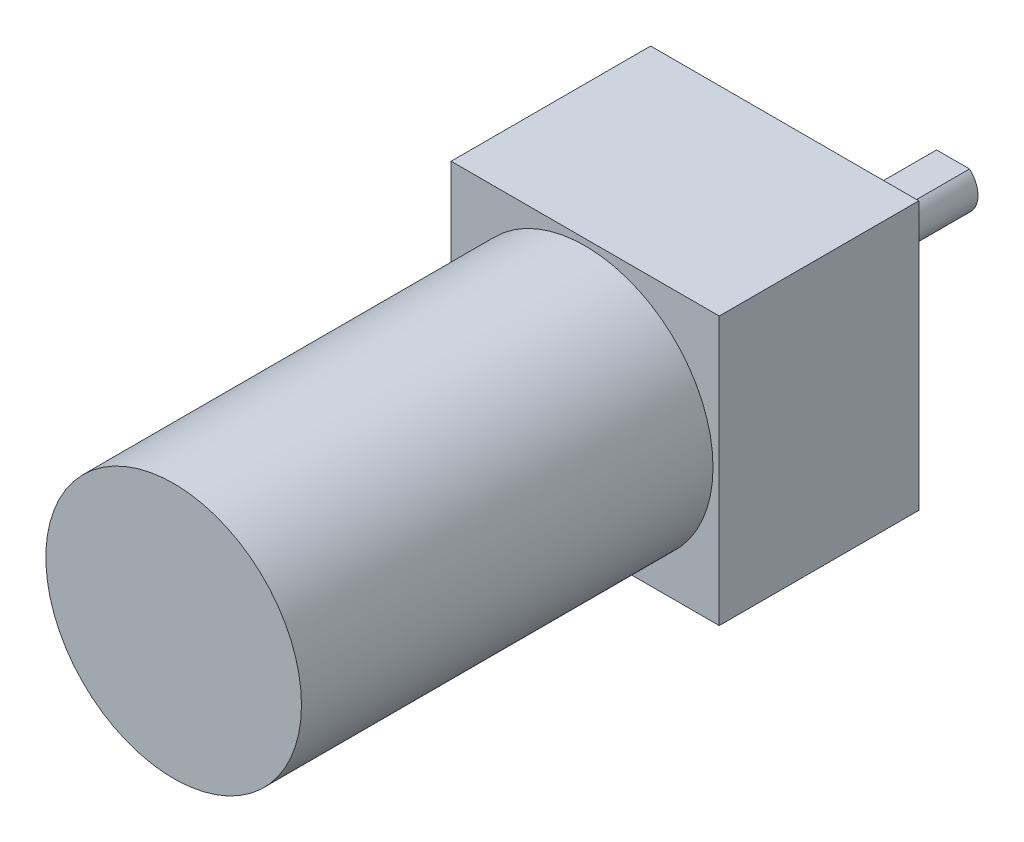
ISO-10303-21;
HEADER;
FILE_DESCRIPTION(('STEP AP214'),'2;1');
FILE_NAME('part.step','',(''),(''),'','','');
FILE_SCHEMA(('AUTOMOTIVE_DESIGN { 1 0 10303 214 1 1 1 1 }'));
ENDSEC;
DATA;
#1=APPLICATION_CONTEXT('core data for automotive mechanical design processes');
#2=APPLICATION_PROTOCOL_DEFINITION('international standard','automotive_design',2000,#1);
#3=PRODUCT_CONTEXT('',#1,'mechanical');
#4=PRODUCT('Part','Part','',(#3));
#5=PRODUCT_RELATED_PRODUCT_CATEGORY('part','',(#4));
#6=PRODUCT_DEFINITION_FORMATION('','',#4);
#7=PRODUCT_DEFINITION_CONTEXT('part definition',#1,'design');
#8=PRODUCT_DEFINITION('design','',#6,#7);
#9=PRODUCT_DEFINITION_SHAPE('','',#8);
#10=(LENGTH_UNIT() NAMED_UNIT(*) SI_UNIT(.MILLI.,.METRE.));
#11=(NAMED_UNIT(*) PLANE_ANGLE_UNIT() SI_UNIT($,.RADIAN.));
#12=(NAMED_UNIT(*) SI_UNIT($,.STERADIAN.) SOLID_ANGLE_UNIT());
#13=UNCERTAINTY_MEASURE_WITH_UNIT(LENGTH_MEASURE(1.E-05),#10,'distance_accuracy_value','');
#14=(GEOMETRIC_REPRESENTATION_CONTEXT(3) GLOBAL_UNCERTAINTY_ASSIGNED_CONTEXT((#13)) GLOBAL_UNIT_ASSIGNED_CONTEXT((#10,
#11,#12)) REPRESENTATION_CONTEXT('',''));
#15=CARTESIAN_POINT('',(0.,0.,0.));
#16=DIRECTION('',(0.,0.,1.));
#17=DIRECTION('',(1.,0.,0.));
#18=AXIS2_PLACEMENT_3D('',#15,#16,#17);
#19=CARTESIAN_POINT('',(-21.5,21.5,32.));
#20=DIRECTION('',(1.,0.,0.));
#21=DIRECTION('',(0.,1.,0.));
#22=AXIS2_PLACEMENT_3D('',#19,#20,#21);
#23=PLANE('',#22);
#24=DIRECTION('',(0.,-1.,0.));
#25=VECTOR('',#24,1.);
#26=CARTESIAN_POINT('',(-21.5,21.5,0.));
#27=LINE('',#26,#25);
#28=CARTESIAN_POINT('',(-21.5,21.5,0.));
#29=VERTEX_POINT('',#28);
#30=CARTESIAN_POINT('',(-21.5,-21.5,0.));
#31=VERTEX_POINT('',#30);
#32=EDGE_CURVE('E121',#29,#31,#27,.T.);
#33=ORIENTED_EDGE('',*,*,#32,.T.);
#34=DIRECTION('',(0.,0.,-1.));
#35=VECTOR('',#34,1.);
#36=CARTESIAN_POINT('',(-21.5,-21.5,32.));
#37=LINE('',#36,#35);
#38=CARTESIAN_POINT('',(-21.5,-21.5,32.));
#39=VERTEX_POINT('',#38);
#40=EDGE_CURVE('E124',#39,#31,#37,.T.);
#41=ORIENTED_EDGE('',*,*,#40,.F.);
#42=DIRECTION('',(0.,-1.,0.));
#43=VECTOR('',#42,1.);
#44=CARTESIAN_POINT('',(-21.5,21.5,32.));
#45=LINE('',#44,#43);
#46=CARTESIAN_POINT('',(-21.5,21.5,32.));
#47=VERTEX_POINT('',#46);
#48=EDGE_CURVE('E125',#47,#39,#45,.T.);
#49=ORIENTED_EDGE('',*,*,#48,.F.);
#50=DIRECTION('',(0.,0.,-1.));
#51=VECTOR('',#50,1.);
#52=CARTESIAN_POINT('',(-21.5,21.5,32.));
#53=LINE('',#52,#51);
#54=EDGE_CURVE('E131',#47,#29,#53,.T.);
#55=ORIENTED_EDGE('',*,*,#54,.T.);
#56=EDGE_LOOP('',(#33,#41,#49,#55));
#57=FACE_BOUND('',#56,.T.);
#58=ADVANCED_FACE('F35',(#57),#23,.F.);
#59=CARTESIAN_POINT('',(-21.5,-21.5,32.));
#60=DIRECTION('',(0.,1.,0.));
#61=DIRECTION('',(-1.,0.,0.));
#62=AXIS2_PLACEMENT_3D('',#59,#60,#61);
#63=PLANE('',#62);
#64=DIRECTION('',(1.,0.,0.));
#65=VECTOR('',#64,1.);
#66=CARTESIAN_POINT('',(-21.5,-21.5,0.));
#67=LINE('',#66,#65);
#68=CARTESIAN_POINT('',(21.5,-21.5,0.));
#69=VERTEX_POINT('',#68);
#70=EDGE_CURVE('E134',#31,#69,#67,.T.);
#71=ORIENTED_EDGE('',*,*,#70,.T.);
#72=DIRECTION('',(0.,0.,-1.));
#73=VECTOR('',#72,1.);
#74=CARTESIAN_POINT('',(21.5,-21.5,32.));
#75=LINE('',#74,#73);
#76=CARTESIAN_POINT('',(21.5,-21.5,32.));
#77=VERTEX_POINT('',#76);
#78=EDGE_CURVE('E142',#77,#69,#75,.T.);
#79=ORIENTED_EDGE('',*,*,#78,.F.);
#80=DIRECTION('',(1.,0.,0.));
#81=VECTOR('',#80,1.);
#82=CARTESIAN_POINT('',(-21.5,-21.5,32.));
#83=LINE('',#82,#81);
#84=EDGE_CURVE('E88',#39,#77,#83,.T.);
#85=ORIENTED_EDGE('',*,*,#84,.F.);
#86=ORIENTED_EDGE('',*,*,#40,.T.);
#87=EDGE_LOOP('',(#71,#79,#85,#86));
#88=FACE_BOUND('',#87,.T.);
#89=ADVANCED_FACE('F146',(#88),#63,.F.);
#90=CARTESIAN_POINT('',(21.5,21.5,32.));
#91=DIRECTION('',(-1.,0.,0.));
#92=DIRECTION('',(0.,0.,1.));
#93=AXIS2_PLACEMENT_3D('',#90,#91,#92);
#94=PLANE('',#93);
#95=DIRECTION('',(0.,1.,0.));
#96=VECTOR('',#95,1.);
#97=CARTESIAN_POINT('',(21.5,21.5,0.));
#98=LINE('',#97,#96);
#99=CARTESIAN_POINT('',(21.5,21.5,0.));
#100=VERTEX_POINT('',#99);
#101=EDGE_CURVE('E136',#69,#100,#98,.T.);
#102=ORIENTED_EDGE('',*,*,#101,.T.);
#103=DIRECTION('',(0.,0.,-1.));
#104=VECTOR('',#103,1.);
#105=CARTESIAN_POINT('',(21.5,21.5,32.));
#106=LINE('',#105,#104);
#107=CARTESIAN_POINT('',(21.5,21.5,32.));
#108=VERTEX_POINT('',#107);
#109=EDGE_CURVE('E140',#108,#100,#106,.T.);
#110=ORIENTED_EDGE('',*,*,#109,.F.);
#111=DIRECTION('',(0.,1.,0.));
#112=VECTOR('',#111,1.);
#113=CARTESIAN_POINT('',(21.5,21.5,32.));
#114=LINE('',#113,#112);
#115=EDGE_CURVE('E128',#77,#108,#114,.T.);
#116=ORIENTED_EDGE('',*,*,#115,.F.);
#117=ORIENTED_EDGE('',*,*,#78,.T.);
#118=EDGE_LOOP('',(#102,#110,#116,#117));
#119=FACE_BOUND('',#118,.T.);
#120=ADVANCED_FACE('F155',(#119),#94,.F.);
#121=CARTESIAN_POINT('',(-21.5,21.5,32.));
#122=DIRECTION('',(0.,-1.,0.));
#123=DIRECTION('',(1.,0.,0.));
#124=AXIS2_PLACEMENT_3D('',#121,#122,#123);
#125=PLANE('',#124);
#126=DIRECTION('',(-1.,0.,0.));
#127=VECTOR('',#126,1.);
#128=CARTESIAN_POINT('',(-21.5,21.5,0.));
#129=LINE('',#128,#127);
#130=EDGE_CURVE('E80',#100,#29,#129,.T.);
#131=ORIENTED_EDGE('',*,*,#130,.T.);
#132=ORIENTED_EDGE('',*,*,#54,.F.);
#133=DIRECTION('',(-1.,0.,0.));
#134=VECTOR('',#133,1.);
#135=CARTESIAN_POINT('',(-21.5,21.5,32.));
#136=LINE('',#135,#134);
#137=EDGE_CURVE('E59',#108,#47,#136,.T.);
#138=ORIENTED_EDGE('',*,*,#137,.F.);
#139=ORIENTED_EDGE('',*,*,#109,.T.);
#140=EDGE_LOOP('',(#131,#132,#138,#139));
#141=FACE_BOUND('',#140,.T.);
#142=ADVANCED_FACE('F157',(#141),#125,.F.);
#143=CARTESIAN_POINT('',(0.,0.,32.));
#144=DIRECTION('',(0.,0.,1.));
#145=DIRECTION('',(1.,0.,0.));
#146=AXIS2_PLACEMENT_3D('',#143,#144,#145);
#147=PLANE('',#146);
#148=CARTESIAN_POINT('',(0.,0.,32.));
#149=DIRECTION('',(0.,0.,1.));
#150=DIRECTION('',(1.,0.,0.));
#151=AXIS2_PLACEMENT_3D('',#148,#149,#150);
#152=CIRCLE('',#151,20.5);
#153=CARTESIAN_POINT('',(20.5,0.,32.));
#154=VERTEX_POINT('',#153);
#155=EDGE_CURVE('E11',#154,#154,#152,.T.);
#156=ORIENTED_EDGE('',*,*,#155,.F.);
#157=EDGE_LOOP('',(#156));
#158=FACE_BOUND('',#157,.T.);
#159=ORIENTED_EDGE('',*,*,#48,.T.);
#160=ORIENTED_EDGE('',*,*,#84,.T.);
#161=ORIENTED_EDGE('',*,*,#115,.T.);
#162=ORIENTED_EDGE('',*,*,#137,.T.);
#163=EDGE_LOOP('',(#159,#160,#161,#162));
#164=FACE_BOUND('',#163,.T.);
#165=ADVANCED_FACE('F158',(#158,#164),#147,.T.);
#166=CARTESIAN_POINT('',(0.,0.,0.));
#167=DIRECTION('',(0.,0.,1.));
#168=DIRECTION('',(1.,0.,0.));
#169=AXIS2_PLACEMENT_3D('',#166,#167,#168);
#170=PLANE('',#169);
#171=CARTESIAN_POINT('',(18.,-18.,0.));
#172=DIRECTION('',(0.,0.,-1.));
#173=DIRECTION('',(1.,0.,0.));
#174=AXIS2_PLACEMENT_3D('',#171,#172,#173);
#175=CIRCLE('',#174,2.);
#176=CARTESIAN_POINT('',(20.,-18.,0.));
#177=VERTEX_POINT('',#176);
#178=EDGE_CURVE('E356',#177,#177,#175,.T.);
#179=ORIENTED_EDGE('',*,*,#178,.F.);
#180=EDGE_LOOP('',(#179));
#181=FACE_BOUND('',#180,.T.);
#182=CARTESIAN_POINT('',(-18.,-18.,0.));
#183=DIRECTION('',(0.,0.,-1.));
#184=DIRECTION('',(-1.,0.,0.));
#185=AXIS2_PLACEMENT_3D('',#182,#183,#184);
#186=CIRCLE('',#185,2.);
#187=CARTESIAN_POINT('',(-20.,-18.,0.));
#188=VERTEX_POINT('',#187);
#189=EDGE_CURVE('E355',#188,#188,#186,.T.);
#190=ORIENTED_EDGE('',*,*,#189,.F.);
#191=EDGE_LOOP('',(#190));
#192=FACE_BOUND('',#191,.T.);
#193=CARTESIAN_POINT('',(-18.,18.,0.));
#194=DIRECTION('',(0.,0.,-1.));
#195=DIRECTION('',(1.,0.,0.));
#196=AXIS2_PLACEMENT_3D('',#193,#194,#195);
#197=CIRCLE('',#196,2.);
#198=CARTESIAN_POINT('',(-16.,18.,0.));
#199=VERTEX_POINT('',#198);
#200=EDGE_CURVE('E381',#199,#199,#197,.T.);
#201=ORIENTED_EDGE('',*,*,#200,.F.);
#202=EDGE_LOOP('',(#201));
#203=FACE_BOUND('',#202,.T.);
#204=CARTESIAN_POINT('',(18.,18.,0.));
#205=DIRECTION('',(0.,0.,-1.));
#206=DIRECTION('',(-1.,0.,0.));
#207=AXIS2_PLACEMENT_3D('',#204,#205,#206);
#208=CIRCLE('',#207,2.);
#209=CARTESIAN_POINT('',(16.,18.,0.));
#210=VERTEX_POINT('',#209);
#211=EDGE_CURVE('E369',#210,#210,#208,.T.);
#212=ORIENTED_EDGE('',*,*,#211,.F.);
#213=EDGE_LOOP('',(#212));
#214=FACE_BOUND('',#213,.T.);
#215=CARTESIAN_POINT('',(0.,0.,0.));
#216=DIRECTION('',(0.,0.,-1.));
#217=DIRECTION('',(0.,1.,0.));
#218=AXIS2_PLACEMENT_3D('',#215,#216,#217);
#219=CIRCLE('',#218,7.);
#220=CARTESIAN_POINT('',(0.,7.,0.));
#221=VERTEX_POINT('',#220);
#222=EDGE_CURVE('E104',#221,#221,#219,.T.);
#223=ORIENTED_EDGE('',*,*,#222,.F.);
#224=EDGE_LOOP('',(#223));
#225=FACE_BOUND('',#224,.T.);
#226=ORIENTED_EDGE('',*,*,#32,.F.);
#227=ORIENTED_EDGE('',*,*,#130,.F.);
#228=ORIENTED_EDGE('',*,*,#101,.F.);
#229=ORIENTED_EDGE('',*,*,#70,.F.);
#230=EDGE_LOOP('',(#226,#227,#228,#229));
#231=FACE_BOUND('',#230,.T.);
#232=ADVANCED_FACE('F151',(#181,#192,#203,#214,#225,#231),#170,.F.);
#233=CARTESIAN_POINT('',(0.,0.,-27.));
#234=DIRECTION('',(0.,0.,-1.));
#235=DIRECTION('',(0.,1.,0.));
#236=AXIS2_PLACEMENT_3D('',#233,#234,#235);
#237=CYLINDRICAL_SURFACE('',#236,7.);
#238=ORIENTED_EDGE('',*,*,#222,.T.);
#239=EDGE_LOOP('',(#238));
#240=FACE_BOUND('',#239,.T.);
#241=CARTESIAN_POINT('',(0.,0.,-7.));
#242=DIRECTION('',(0.,0.,-1.));
#243=DIRECTION('',(0.,1.,0.));
#244=AXIS2_PLACEMENT_3D('',#241,#242,#243);
#245=CIRCLE('',#244,7.);
#246=CARTESIAN_POINT('',(0.,7.,-7.));
#247=VERTEX_POINT('',#246);
#248=EDGE_CURVE('E115',#247,#247,#245,.T.);
#249=ORIENTED_EDGE('',*,*,#248,.F.);
#250=EDGE_LOOP('',(#249));
#251=FACE_BOUND('',#250,.T.);
#252=ADVANCED_FACE('F166',(#240,#251),#237,.T.);
#253=CARTESIAN_POINT('',(0.,7.,-7.));
#254=DIRECTION('',(0.,0.,-1.));
#255=DIRECTION('',(0.,1.,0.));
#256=AXIS2_PLACEMENT_3D('',#253,#254,#255);
#257=PLANE('',#256);
#258=ORIENTED_EDGE('',*,*,#248,.T.);
#259=EDGE_LOOP('',(#258));
#260=FACE_BOUND('',#259,.T.);
#261=CARTESIAN_POINT('',(0.,0.,-7.));
#262=DIRECTION('',(0.,0.,-1.));
#263=DIRECTION('',(0.,1.,0.));
#264=AXIS2_PLACEMENT_3D('',#261,#262,#263);
#265=CIRCLE('',#264,4.);
#266=CARTESIAN_POINT('',(0.,4.,-7.));
#267=VERTEX_POINT('',#266);
#268=EDGE_CURVE('E112',#267,#267,#265,.T.);
#269=ORIENTED_EDGE('',*,*,#268,.F.);
#270=EDGE_LOOP('',(#269));
#271=FACE_BOUND('',#270,.T.);
#272=ADVANCED_FACE('F196',(#260,#271),#257,.T.);
#273=CARTESIAN_POINT('',(0.,0.,-27.));
#274=DIRECTION('',(0.,0.,-1.));
#275=DIRECTION('',(0.,1.,0.));
#276=AXIS2_PLACEMENT_3D('',#273,#274,#275);
#277=CYLINDRICAL_SURFACE('',#276,4.);
#278=DIRECTION('',(0.,0.,-1.));
#279=VECTOR('',#278,1.);
#280=CARTESIAN_POINT('',(-2.64575131106458,3.,-27.));
#281=LINE('',#280,#279);
#282=CARTESIAN_POINT('',(-2.64575131106458,3.,-27.));
#283=VERTEX_POINT('',#282);
#284=CARTESIAN_POINT('',(-2.64575131106458,3.,-9.00000000000001));
#285=VERTEX_POINT('',#284);
#286=EDGE_CURVE('E99',#283,#285,#281,.F.);
#287=ORIENTED_EDGE('',*,*,#286,.F.);
#288=CARTESIAN_POINT('',(0.,0.,-27.));
#289=DIRECTION('',(0.,0.,-1.));
#290=DIRECTION('',(0.,1.,0.));
#291=AXIS2_PLACEMENT_3D('',#288,#289,#290);
#292=CIRCLE('',#291,3.99999999999999);
#293=CARTESIAN_POINT('',(2.64575131106458,3.,-27.));
#294=VERTEX_POINT('',#293);
#295=EDGE_CURVE('E109',#294,#283,#292,.T.);
#296=ORIENTED_EDGE('',*,*,#295,.F.);
#297=DIRECTION('',(0.,0.,-1.));
#298=VECTOR('',#297,1.);
#299=CARTESIAN_POINT('',(2.64575131106458,3.,-27.));
#300=LINE('',#299,#298);
#301=CARTESIAN_POINT('',(2.64575131106458,3.,-9.00000000000001));
#302=VERTEX_POINT('',#301);
#303=EDGE_CURVE('E50',#302,#294,#300,.T.);
#304=ORIENTED_EDGE('',*,*,#303,.F.);
#305=CARTESIAN_POINT('',(0.,0.,-9.00000000000001));
#306=DIRECTION('',(0.,0.,-1.));
#307=DIRECTION('',(-1.,0.,0.));
#308=AXIS2_PLACEMENT_3D('',#305,#306,#307);
#309=CIRCLE('',#308,4.);
#310=EDGE_CURVE('E38',#302,#285,#309,.F.);
#311=ORIENTED_EDGE('',*,*,#310,.T.);
#312=EDGE_LOOP('',(#287,#296,#304,#311));
#313=FACE_BOUND('',#312,.T.);
#314=ORIENTED_EDGE('',*,*,#268,.T.);
#315=EDGE_LOOP('',(#314));
#316=FACE_BOUND('',#315,.T.);
#317=ADVANCED_FACE('F107',(#313,#316),#277,.T.);
#318=CARTESIAN_POINT('',(0.,4.,-27.));
#319=DIRECTION('',(0.,0.,-1.));
#320=DIRECTION('',(0.,1.,0.));
#321=AXIS2_PLACEMENT_3D('',#318,#319,#320);
#322=PLANE('',#321);
#323=DIRECTION('',(-1.,0.,0.));
#324=VECTOR('',#323,1.);
#325=CARTESIAN_POINT('',(0.,3.,-27.));
#326=LINE('',#325,#324);
#327=EDGE_CURVE('E96',#294,#283,#326,.T.);
#328=ORIENTED_EDGE('',*,*,#327,.F.);
#329=ORIENTED_EDGE('',*,*,#295,.T.);
#330=EDGE_LOOP('',(#328,#329));
#331=FACE_BOUND('',#330,.T.);
#332=ADVANCED_FACE('F111',(#331),#322,.T.);
#333=CARTESIAN_POINT('',(4.92027350574334,3.,-9.00000000000001));
#334=DIRECTION('',(0.,-1.,0.));
#335=DIRECTION('',(0.,0.,-1.));
#336=AXIS2_PLACEMENT_3D('',#333,#334,#335);
#337=PLANE('',#336);
#338=ORIENTED_EDGE('',*,*,#286,.T.);
#339=DIRECTION('',(-1.,0.,0.));
#340=VECTOR('',#339,1.);
#341=CARTESIAN_POINT('',(4.92027350574334,3.,-9.00000000000001));
#342=LINE('',#341,#340);
#343=EDGE_CURVE('E374',#302,#285,#342,.T.);
#344=ORIENTED_EDGE('',*,*,#343,.F.);
#345=ORIENTED_EDGE('',*,*,#303,.T.);
#346=ORIENTED_EDGE('',*,*,#327,.T.);
#347=EDGE_LOOP('',(#338,#344,#345,#346));
#348=FACE_BOUND('',#347,.T.);
#349=ADVANCED_FACE('F98',(#348),#337,.F.);
#350=CARTESIAN_POINT('',(0.,0.,-9.00000000000001));
#351=DIRECTION('',(0.,0.,-1.));
#352=DIRECTION('',(-1.,0.,0.));
#353=AXIS2_PLACEMENT_3D('',#350,#351,#352);
#354=PLANE('',#353);
#355=ORIENTED_EDGE('',*,*,#343,.T.);
#356=ORIENTED_EDGE('',*,*,#310,.F.);
#357=EDGE_LOOP('',(#355,#356));
#358=FACE_BOUND('',#357,.T.);
#359=ADVANCED_FACE('F231',(#358),#354,.T.);
#360=CARTESIAN_POINT('',(0.,0.,98.));
#361=DIRECTION('',(0.,0.,-1.));
#362=DIRECTION('',(-1.,0.,0.));
#363=AXIS2_PLACEMENT_3D('',#360,#361,#362);
#364=CYLINDRICAL_SURFACE('',#363,20.5);
#365=CARTESIAN_POINT('',(0.,0.,98.));
#366=DIRECTION('',(0.,0.,1.));
#367=DIRECTION('',(1.,0.,0.));
#368=AXIS2_PLACEMENT_3D('',#365,#366,#367);
#369=CIRCLE('',#368,20.5);
#370=CARTESIAN_POINT('',(20.5,0.,98.));
#371=VERTEX_POINT('',#370);
#372=EDGE_CURVE('E368',#371,#371,#369,.T.);
#373=ORIENTED_EDGE('',*,*,#372,.F.);
#374=EDGE_LOOP('',(#373));
#375=FACE_BOUND('',#374,.T.);
#376=ORIENTED_EDGE('',*,*,#155,.T.);
#377=EDGE_LOOP('',(#376));
#378=FACE_BOUND('',#377,.T.);
#379=ADVANCED_FACE('F239',(#375,#378),#364,.T.);
#380=CARTESIAN_POINT('',(0.,0.,98.));
#381=DIRECTION('',(0.,0.,1.));
#382=DIRECTION('',(1.,0.,0.));
#383=AXIS2_PLACEMENT_3D('',#380,#381,#382);
#384=PLANE('',#383);
#385=ORIENTED_EDGE('',*,*,#372,.T.);
#386=EDGE_LOOP('',(#385));
#387=FACE_BOUND('',#386,.T.);
#388=ADVANCED_FACE('F253',(#387),#384,.T.);
#389=CARTESIAN_POINT('',(18.,18.,30.));
#390=DIRECTION('',(0.,0.,-1.));
#391=DIRECTION('',(-1.,0.,0.));
#392=AXIS2_PLACEMENT_3D('',#389,#390,#391);
#393=CYLINDRICAL_SURFACE('',#392,2.);
#394=CARTESIAN_POINT('',(18.,18.,30.));
#395=DIRECTION('',(0.,0.,-1.));
#396=DIRECTION('',(-1.,0.,0.));
#397=AXIS2_PLACEMENT_3D('',#394,#395,#396);
#398=CIRCLE('',#397,2.);
#399=CARTESIAN_POINT('',(16.,18.,30.));
#400=VERTEX_POINT('',#399);
#401=EDGE_CURVE('E365',#400,#400,#398,.T.);
#402=ORIENTED_EDGE('',*,*,#401,.F.);
#403=EDGE_LOOP('',(#402));
#404=FACE_BOUND('',#403,.T.);
#405=ORIENTED_EDGE('',*,*,#211,.T.);
#406=EDGE_LOOP('',(#405));
#407=FACE_BOUND('',#406,.T.);
#408=ADVANCED_FACE('F263',(#404,#407),#393,.F.);
#409=CARTESIAN_POINT('',(18.,18.,30.));
#410=DIRECTION('',(0.,0.,-1.));
#411=DIRECTION('',(-1.,0.,0.));
#412=AXIS2_PLACEMENT_3D('',#409,#410,#411);
#413=PLANE('',#412);
#414=ORIENTED_EDGE('',*,*,#401,.T.);
#415=EDGE_LOOP('',(#414));
#416=FACE_BOUND('',#415,.T.);
#417=ADVANCED_FACE('F278',(#416),#413,.T.);
#418=CARTESIAN_POINT('',(-18.,18.,30.));
#419=DIRECTION('',(0.,0.,-1.));
#420=DIRECTION('',(-1.,0.,0.));
#421=AXIS2_PLACEMENT_3D('',#418,#419,#420);
#422=CYLINDRICAL_SURFACE('',#421,2.);
#423=CARTESIAN_POINT('',(-18.,18.,30.));
#424=DIRECTION('',(0.,0.,-1.));
#425=DIRECTION('',(1.,0.,0.));
#426=AXIS2_PLACEMENT_3D('',#423,#424,#425);
#427=CIRCLE('',#426,2.);
#428=CARTESIAN_POINT('',(-16.,18.,30.));
#429=VERTEX_POINT('',#428);
#430=EDGE_CURVE('E372',#429,#429,#427,.T.);
#431=ORIENTED_EDGE('',*,*,#430,.F.);
#432=EDGE_LOOP('',(#431));
#433=FACE_BOUND('',#432,.T.);
#434=ORIENTED_EDGE('',*,*,#200,.T.);
#435=EDGE_LOOP('',(#434));
#436=FACE_BOUND('',#435,.T.);
#437=ADVANCED_FACE('F288',(#433,#436),#422,.F.);
#438=CARTESIAN_POINT('',(-18.,18.,30.));
#439=DIRECTION('',(0.,0.,1.));
#440=DIRECTION('',(1.,0.,0.));
#441=AXIS2_PLACEMENT_3D('',#438,#439,#440);
#442=PLANE('',#441);
#443=ORIENTED_EDGE('',*,*,#430,.T.);
#444=EDGE_LOOP('',(#443));
#445=FACE_BOUND('',#444,.T.);
#446=ADVANCED_FACE('F298',(#445),#442,.F.);
#447=CARTESIAN_POINT('',(-18.,-18.,30.));
#448=DIRECTION('',(0.,0.,-1.));
#449=DIRECTION('',(-1.,0.,0.));
#450=AXIS2_PLACEMENT_3D('',#447,#448,#449);
#451=CYLINDRICAL_SURFACE('',#450,2.);
#452=CARTESIAN_POINT('',(-18.,-18.,30.));
#453=DIRECTION('',(0.,0.,-1.));
#454=DIRECTION('',(-1.,0.,0.));
#455=AXIS2_PLACEMENT_3D('',#452,#453,#454);
#456=CIRCLE('',#455,2.);
#457=CARTESIAN_POINT('',(-20.,-18.,30.));
#458=VERTEX_POINT('',#457);
#459=EDGE_CURVE('E359',#458,#458,#456,.T.);
#460=ORIENTED_EDGE('',*,*,#459,.F.);
#461=EDGE_LOOP('',(#460));
#462=FACE_BOUND('',#461,.T.);
#463=ORIENTED_EDGE('',*,*,#189,.T.);
#464=EDGE_LOOP('',(#463));
#465=FACE_BOUND('',#464,.T.);
#466=ADVANCED_FACE('F308',(#462,#465),#451,.F.);
#467=CARTESIAN_POINT('',(-18.,-18.,30.));
#468=DIRECTION('',(0.,0.,-1.));
#469=DIRECTION('',(-1.,0.,0.));
#470=AXIS2_PLACEMENT_3D('',#467,#468,#469);
#471=PLANE('',#470);
#472=ORIENTED_EDGE('',*,*,#459,.T.);
#473=EDGE_LOOP('',(#472));
#474=FACE_BOUND('',#473,.T.);
#475=ADVANCED_FACE('F318',(#474),#471,.T.);
#476=CARTESIAN_POINT('',(18.,-18.,30.));
#477=DIRECTION('',(0.,0.,-1.));
#478=DIRECTION('',(-1.,0.,0.));
#479=AXIS2_PLACEMENT_3D('',#476,#477,#478);
#480=CYLINDRICAL_SURFACE('',#479,2.);
#481=CARTESIAN_POINT('',(18.,-18.,30.));
#482=DIRECTION('',(0.,0.,-1.));
#483=DIRECTION('',(1.,0.,0.));
#484=AXIS2_PLACEMENT_3D('',#481,#482,#483);
#485=CIRCLE('',#484,2.);
#486=CARTESIAN_POINT('',(20.,-18.,30.));
#487=VERTEX_POINT('',#486);
#488=EDGE_CURVE('E354',#487,#487,#485,.T.);
#489=ORIENTED_EDGE('',*,*,#488,.F.);
#490=EDGE_LOOP('',(#489));
#491=FACE_BOUND('',#490,.T.);
#492=ORIENTED_EDGE('',*,*,#178,.T.);
#493=EDGE_LOOP('',(#492));
#494=FACE_BOUND('',#493,.T.);
#495=ADVANCED_FACE('F328',(#491,#494),#480,.F.);
#496=CARTESIAN_POINT('',(18.,-18.,30.));
#497=DIRECTION('',(0.,0.,1.));
#498=DIRECTION('',(1.,0.,0.));
#499=AXIS2_PLACEMENT_3D('',#496,#497,#498);
#500=PLANE('',#499);
#501=ORIENTED_EDGE('',*,*,#488,.T.);
#502=EDGE_LOOP('',(#501));
#503=FACE_BOUND('',#502,.T.);
#504=ADVANCED_FACE('F338',(#503),#500,.F.);
#505=CLOSED_SHELL('',(#58,#89,#120,#142,#165,#232,#252,#272,#317,#332,#349,#359,#379,#388,#408,
#417,#437,#446,#466,#475,#495,#504));
#506=MANIFOLD_SOLID_BREP('B2',#505);
#507=ADVANCED_BREP_SHAPE_REPRESENTATION('',(#18,#506),#14);
#508=SHAPE_DEFINITION_REPRESENTATION(#9,#507);
ENDSEC;
END-ISO-10303-21;
